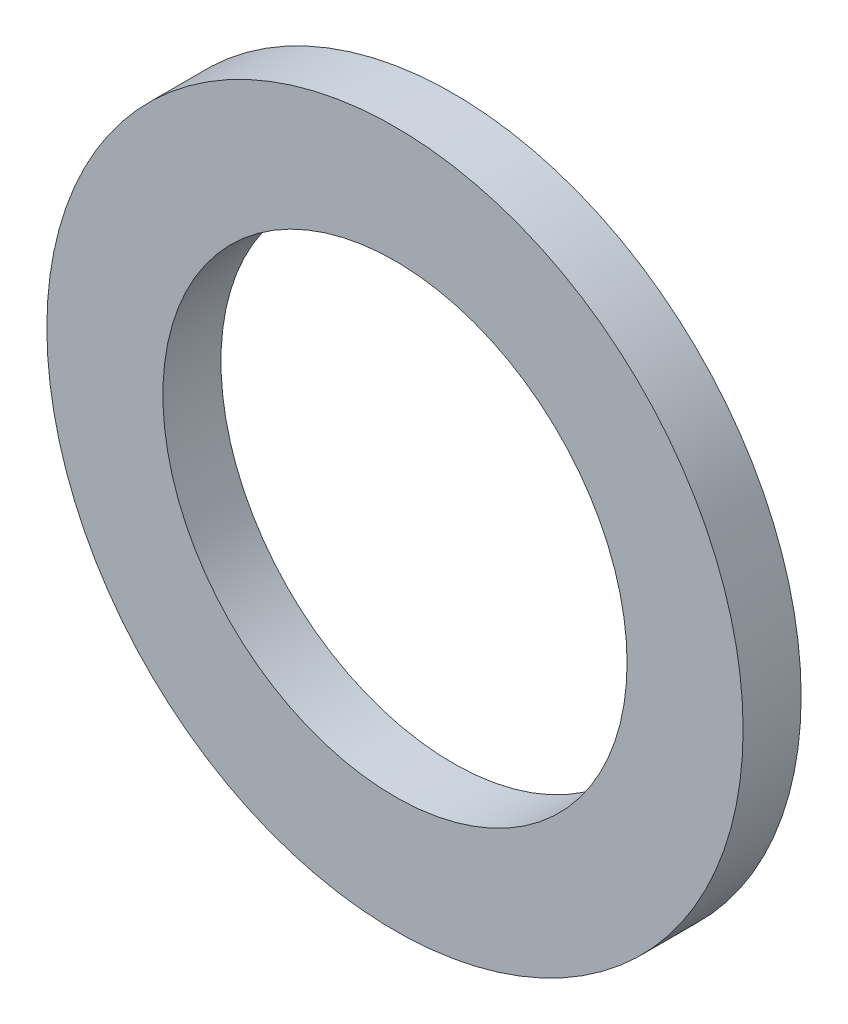
ISO-10303-21;
HEADER;
FILE_DESCRIPTION(('STEP AP214'),'2;1');
FILE_NAME('part.step','',(''),(''),'','','');
FILE_SCHEMA(('AUTOMOTIVE_DESIGN { 1 0 10303 214 1 1 1 1 }'));
ENDSEC;
DATA;
#1=APPLICATION_CONTEXT('core data for automotive mechanical design processes');
#2=APPLICATION_PROTOCOL_DEFINITION('international standard','automotive_design',2000,#1);
#3=PRODUCT_CONTEXT('',#1,'mechanical');
#4=PRODUCT('Part','Part','',(#3));
#5=PRODUCT_RELATED_PRODUCT_CATEGORY('part','',(#4));
#6=PRODUCT_DEFINITION_FORMATION('','',#4);
#7=PRODUCT_DEFINITION_CONTEXT('part definition',#1,'design');
#8=PRODUCT_DEFINITION('design','',#6,#7);
#9=PRODUCT_DEFINITION_SHAPE('','',#8);
#10=(LENGTH_UNIT() NAMED_UNIT(*) SI_UNIT(.MILLI.,.METRE.));
#11=(NAMED_UNIT(*) PLANE_ANGLE_UNIT() SI_UNIT($,.RADIAN.));
#12=(NAMED_UNIT(*) SI_UNIT($,.STERADIAN.) SOLID_ANGLE_UNIT());
#13=UNCERTAINTY_MEASURE_WITH_UNIT(LENGTH_MEASURE(1.E-05),#10,'distance_accuracy_value','');
#14=(GEOMETRIC_REPRESENTATION_CONTEXT(3) GLOBAL_UNCERTAINTY_ASSIGNED_CONTEXT((#13)) GLOBAL_UNIT_ASSIGNED_CONTEXT((#10,
#11,#12)) REPRESENTATION_CONTEXT('',''));
#15=CARTESIAN_POINT('',(0.,0.,0.));
#16=DIRECTION('',(0.,0.,1.));
#17=DIRECTION('',(1.,0.,0.));
#18=AXIS2_PLACEMENT_3D('',#15,#16,#17);
#19=CARTESIAN_POINT('',(0.,0.,1.5875));
#20=DIRECTION('',(0.,0.,1.));
#21=DIRECTION('',(1.,0.,0.));
#22=AXIS2_PLACEMENT_3D('',#19,#20,#21);
#23=PLANE('',#22);
#24=CARTESIAN_POINT('',(0.,0.,1.5875));
#25=DIRECTION('',(0.,0.,1.));
#26=DIRECTION('',(1.,0.,0.));
#27=AXIS2_PLACEMENT_3D('',#24,#25,#26);
#28=CIRCLE('',#27,9.525);
#29=CARTESIAN_POINT('',(9.525,0.,1.5875));
#30=VERTEX_POINT('',#29);
#31=EDGE_CURVE('E10',#30,#30,#28,.T.);
#32=ORIENTED_EDGE('',*,*,#31,.T.);
#33=EDGE_LOOP('',(#32));
#34=FACE_BOUND('',#33,.T.);
#35=CARTESIAN_POINT('',(0.,0.,1.5875));
#36=DIRECTION('',(0.,0.,1.));
#37=DIRECTION('',(1.,0.,0.));
#38=AXIS2_PLACEMENT_3D('',#35,#36,#37);
#39=CIRCLE('',#38,6.35);
#40=CARTESIAN_POINT('',(6.35,0.,1.5875));
#41=VERTEX_POINT('',#40);
#42=EDGE_CURVE('E42',#41,#41,#39,.T.);
#43=ORIENTED_EDGE('',*,*,#42,.F.);
#44=EDGE_LOOP('',(#43));
#45=FACE_BOUND('',#44,.T.);
#46=ADVANCED_FACE('F31',(#34,#45),#23,.T.);
#47=CARTESIAN_POINT('',(0.,0.,0.));
#48=DIRECTION('',(0.,0.,1.));
#49=DIRECTION('',(1.,0.,0.));
#50=AXIS2_PLACEMENT_3D('',#47,#48,#49);
#51=PLANE('',#50);
#52=CARTESIAN_POINT('',(0.,0.,0.));
#53=DIRECTION('',(0.,0.,1.));
#54=DIRECTION('',(1.,0.,0.));
#55=AXIS2_PLACEMENT_3D('',#52,#53,#54);
#56=CIRCLE('',#55,9.525);
#57=CARTESIAN_POINT('',(9.525,0.,0.));
#58=VERTEX_POINT('',#57);
#59=EDGE_CURVE('E35',#58,#58,#56,.T.);
#60=ORIENTED_EDGE('',*,*,#59,.F.);
#61=EDGE_LOOP('',(#60));
#62=FACE_BOUND('',#61,.T.);
#63=CARTESIAN_POINT('',(0.,0.,0.));
#64=DIRECTION('',(0.,0.,1.));
#65=DIRECTION('',(1.,0.,0.));
#66=AXIS2_PLACEMENT_3D('',#63,#64,#65);
#67=CIRCLE('',#66,6.35);
#68=CARTESIAN_POINT('',(6.35,0.,0.));
#69=VERTEX_POINT('',#68);
#70=EDGE_CURVE('E44',#69,#69,#67,.T.);
#71=ORIENTED_EDGE('',*,*,#70,.T.);
#72=EDGE_LOOP('',(#71));
#73=FACE_BOUND('',#72,.T.);
#74=ADVANCED_FACE('F54',(#62,#73),#51,.F.);
#75=CARTESIAN_POINT('',(0.,0.,1.5875));
#76=DIRECTION('',(0.,0.,-1.));
#77=DIRECTION('',(-1.,0.,0.));
#78=AXIS2_PLACEMENT_3D('',#75,#76,#77);
#79=CYLINDRICAL_SURFACE('',#78,9.525);
#80=ORIENTED_EDGE('',*,*,#31,.F.);
#81=EDGE_LOOP('',(#80));
#82=FACE_BOUND('',#81,.T.);
#83=ORIENTED_EDGE('',*,*,#59,.T.);
#84=EDGE_LOOP('',(#83));
#85=FACE_BOUND('',#84,.T.);
#86=ADVANCED_FACE('F33',(#82,#85),#79,.T.);
#87=CARTESIAN_POINT('',(0.,0.,1.5875));
#88=DIRECTION('',(0.,0.,-1.));
#89=DIRECTION('',(-1.,0.,0.));
#90=AXIS2_PLACEMENT_3D('',#87,#88,#89);
#91=CYLINDRICAL_SURFACE('',#90,6.35);
#92=ORIENTED_EDGE('',*,*,#42,.T.);
#93=EDGE_LOOP('',(#92));
#94=FACE_BOUND('',#93,.T.);
#95=ORIENTED_EDGE('',*,*,#70,.F.);
#96=EDGE_LOOP('',(#95));
#97=FACE_BOUND('',#96,.T.);
#98=ADVANCED_FACE('F50',(#94,#97),#91,.F.);
#99=CLOSED_SHELL('',(#46,#74,#86,#98));
#100=MANIFOLD_SOLID_BREP('B2',#99);
#101=ADVANCED_BREP_SHAPE_REPRESENTATION('',(#18,#100),#14);
#102=SHAPE_DEFINITION_REPRESENTATION(#9,#101);
ENDSEC;
END-ISO-10303-21;
